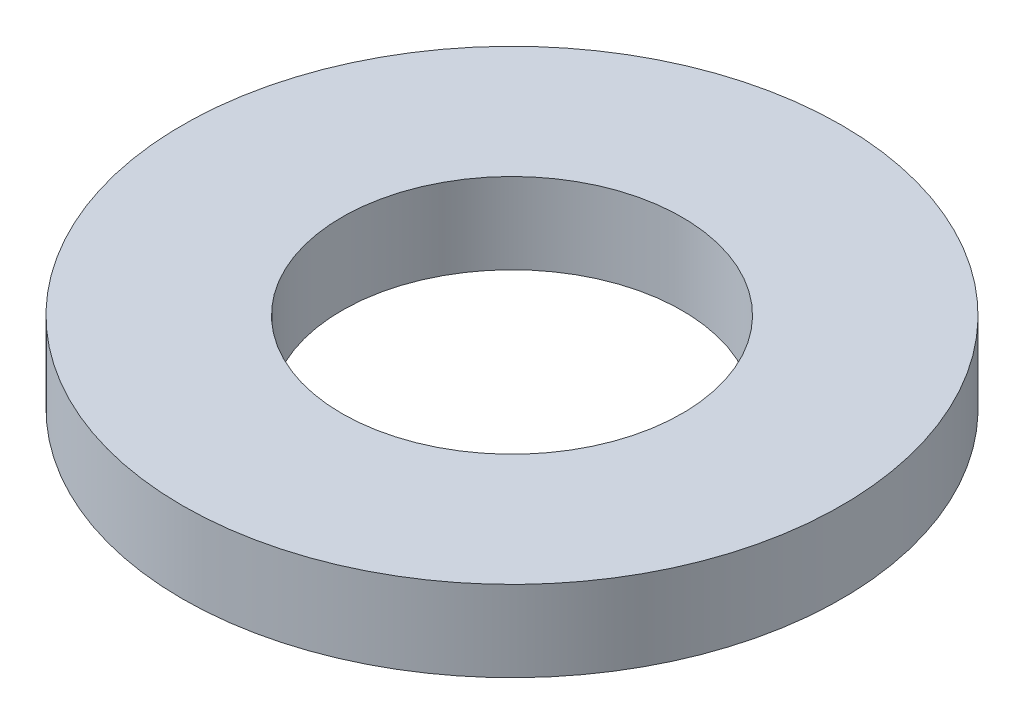
ISO-10303-21;
HEADER;
FILE_DESCRIPTION(('STEP AP214'),'2;1');
FILE_NAME('part.step','',(''),(''),'','','');
FILE_SCHEMA(('AUTOMOTIVE_DESIGN { 1 0 10303 214 1 1 1 1 }'));
ENDSEC;
DATA;
#1=APPLICATION_CONTEXT('core data for automotive mechanical design processes');
#2=APPLICATION_PROTOCOL_DEFINITION('international standard','automotive_design',2000,#1);
#3=PRODUCT_CONTEXT('',#1,'mechanical');
#4=PRODUCT('Part','Part','',(#3));
#5=PRODUCT_RELATED_PRODUCT_CATEGORY('part','',(#4));
#6=PRODUCT_DEFINITION_FORMATION('','',#4);
#7=PRODUCT_DEFINITION_CONTEXT('part definition',#1,'design');
#8=PRODUCT_DEFINITION('design','',#6,#7);
#9=PRODUCT_DEFINITION_SHAPE('','',#8);
#10=(LENGTH_UNIT() NAMED_UNIT(*) SI_UNIT(.MILLI.,.METRE.));
#11=(NAMED_UNIT(*) PLANE_ANGLE_UNIT() SI_UNIT($,.RADIAN.));
#12=(NAMED_UNIT(*) SI_UNIT($,.STERADIAN.) SOLID_ANGLE_UNIT());
#13=UNCERTAINTY_MEASURE_WITH_UNIT(LENGTH_MEASURE(1.E-05),#10,'distance_accuracy_value','');
#14=(GEOMETRIC_REPRESENTATION_CONTEXT(3) GLOBAL_UNCERTAINTY_ASSIGNED_CONTEXT((#13)) GLOBAL_UNIT_ASSIGNED_CONTEXT((#10,
#11,#12)) REPRESENTATION_CONTEXT('',''));
#15=CARTESIAN_POINT('',(0.,0.,0.));
#16=DIRECTION('',(0.,0.,1.));
#17=DIRECTION('',(1.,0.,0.));
#18=AXIS2_PLACEMENT_3D('',#15,#16,#17);
#19=CARTESIAN_POINT('',(0.,19.,0.));
#20=DIRECTION('',(0.,-1.,0.));
#21=DIRECTION('',(0.,0.,-1.));
#22=AXIS2_PLACEMENT_3D('',#19,#20,#21);
#23=CYLINDRICAL_SURFACE('',#22,77.5);
#24=CARTESIAN_POINT('',(0.,19.,0.));
#25=DIRECTION('',(0.,1.,0.));
#26=DIRECTION('',(0.,0.,1.));
#27=AXIS2_PLACEMENT_3D('',#24,#25,#26);
#28=CIRCLE('',#27,77.5);
#29=CARTESIAN_POINT('',(0.,19.,77.5));
#30=VERTEX_POINT('',#29);
#31=EDGE_CURVE('E10',#30,#30,#28,.T.);
#32=ORIENTED_EDGE('',*,*,#31,.F.);
#33=EDGE_LOOP('',(#32));
#34=FACE_BOUND('',#33,.T.);
#35=CARTESIAN_POINT('',(0.,0.,0.));
#36=DIRECTION('',(0.,1.,0.));
#37=DIRECTION('',(0.,0.,1.));
#38=AXIS2_PLACEMENT_3D('',#35,#36,#37);
#39=CIRCLE('',#38,77.5);
#40=CARTESIAN_POINT('',(0.,0.,77.5));
#41=VERTEX_POINT('',#40);
#42=EDGE_CURVE('E37',#41,#41,#39,.T.);
#43=ORIENTED_EDGE('',*,*,#42,.T.);
#44=EDGE_LOOP('',(#43));
#45=FACE_BOUND('',#44,.T.);
#46=ADVANCED_FACE('F40',(#34,#45),#23,.T.);
#47=CARTESIAN_POINT('',(0.,19.,0.));
#48=DIRECTION('',(0.,1.,0.));
#49=DIRECTION('',(0.,0.,1.));
#50=AXIS2_PLACEMENT_3D('',#47,#48,#49);
#51=PLANE('',#50);
#52=CARTESIAN_POINT('',(0.,19.,0.));
#53=DIRECTION('',(0.,1.,0.));
#54=DIRECTION('',(0.,0.,1.));
#55=AXIS2_PLACEMENT_3D('',#52,#53,#54);
#56=CIRCLE('',#55,40.);
#57=CARTESIAN_POINT('',(0.,19.,40.));
#58=VERTEX_POINT('',#57);
#59=EDGE_CURVE('E50',#58,#58,#56,.T.);
#60=ORIENTED_EDGE('',*,*,#59,.F.);
#61=EDGE_LOOP('',(#60));
#62=FACE_BOUND('',#61,.T.);
#63=ORIENTED_EDGE('',*,*,#31,.T.);
#64=EDGE_LOOP('',(#63));
#65=FACE_BOUND('',#64,.T.);
#66=ADVANCED_FACE('F59',(#62,#65),#51,.T.);
#67=CARTESIAN_POINT('',(0.,0.,0.));
#68=DIRECTION('',(0.,1.,0.));
#69=DIRECTION('',(0.,0.,1.));
#70=AXIS2_PLACEMENT_3D('',#67,#68,#69);
#71=PLANE('',#70);
#72=CARTESIAN_POINT('',(0.,0.,0.));
#73=DIRECTION('',(0.,1.,0.));
#74=DIRECTION('',(0.,0.,1.));
#75=AXIS2_PLACEMENT_3D('',#72,#73,#74);
#76=CIRCLE('',#75,40.);
#77=CARTESIAN_POINT('',(0.,0.,40.));
#78=VERTEX_POINT('',#77);
#79=EDGE_CURVE('E47',#78,#78,#76,.T.);
#80=ORIENTED_EDGE('',*,*,#79,.T.);
#81=EDGE_LOOP('',(#80));
#82=FACE_BOUND('',#81,.T.);
#83=ORIENTED_EDGE('',*,*,#42,.F.);
#84=EDGE_LOOP('',(#83));
#85=FACE_BOUND('',#84,.T.);
#86=ADVANCED_FACE('F58',(#82,#85),#71,.F.);
#87=CARTESIAN_POINT('',(0.,19.,0.));
#88=DIRECTION('',(0.,-1.,0.));
#89=DIRECTION('',(0.,0.,-1.));
#90=AXIS2_PLACEMENT_3D('',#87,#88,#89);
#91=CYLINDRICAL_SURFACE('',#90,40.);
#92=ORIENTED_EDGE('',*,*,#59,.T.);
#93=EDGE_LOOP('',(#92));
#94=FACE_BOUND('',#93,.T.);
#95=ORIENTED_EDGE('',*,*,#79,.F.);
#96=EDGE_LOOP('',(#95));
#97=FACE_BOUND('',#96,.T.);
#98=ADVANCED_FACE('F54',(#94,#97),#91,.F.);
#99=CLOSED_SHELL('',(#46,#66,#86,#98));
#100=MANIFOLD_SOLID_BREP('B2',#99);
#101=ADVANCED_BREP_SHAPE_REPRESENTATION('',(#18,#100),#14);
#102=SHAPE_DEFINITION_REPRESENTATION(#9,#101);
ENDSEC;
END-ISO-10303-21;
